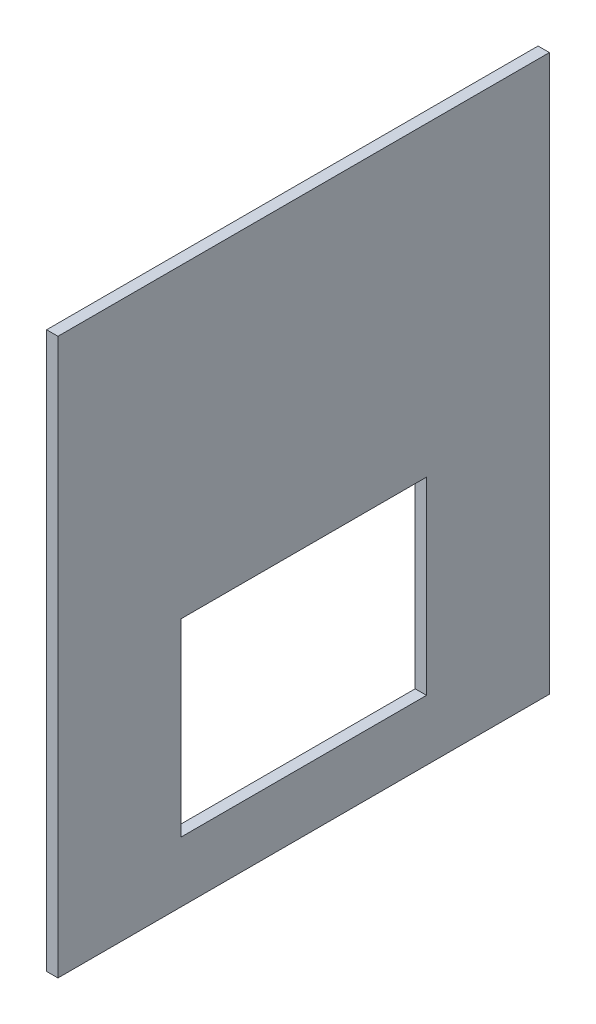
ISO-10303-21;
HEADER;
FILE_DESCRIPTION(('STEP AP214'),'2;1');
FILE_NAME('part.step','',(''),(''),'','','');
FILE_SCHEMA(('AUTOMOTIVE_DESIGN { 1 0 10303 214 1 1 1 1 }'));
ENDSEC;
DATA;
#1=APPLICATION_CONTEXT('core data for automotive mechanical design processes');
#2=APPLICATION_PROTOCOL_DEFINITION('international standard','automotive_design',2000,#1);
#3=PRODUCT_CONTEXT('',#1,'mechanical');
#4=PRODUCT('Part','Part','',(#3));
#5=PRODUCT_RELATED_PRODUCT_CATEGORY('part','',(#4));
#6=PRODUCT_DEFINITION_FORMATION('','',#4);
#7=PRODUCT_DEFINITION_CONTEXT('part definition',#1,'design');
#8=PRODUCT_DEFINITION('design','',#6,#7);
#9=PRODUCT_DEFINITION_SHAPE('','',#8);
#10=(LENGTH_UNIT() NAMED_UNIT(*) SI_UNIT(.MILLI.,.METRE.));
#11=(NAMED_UNIT(*) PLANE_ANGLE_UNIT() SI_UNIT($,.RADIAN.));
#12=(NAMED_UNIT(*) SI_UNIT($,.STERADIAN.) SOLID_ANGLE_UNIT());
#13=UNCERTAINTY_MEASURE_WITH_UNIT(LENGTH_MEASURE(1.E-05),#10,'distance_accuracy_value','');
#14=(GEOMETRIC_REPRESENTATION_CONTEXT(3) GLOBAL_UNCERTAINTY_ASSIGNED_CONTEXT((#13)) GLOBAL_UNIT_ASSIGNED_CONTEXT((#10,
#11,#12)) REPRESENTATION_CONTEXT('',''));
#15=CARTESIAN_POINT('',(0.,0.,0.));
#16=DIRECTION('',(0.,0.,1.));
#17=DIRECTION('',(1.,0.,0.));
#18=AXIS2_PLACEMENT_3D('',#15,#16,#17);
#19=CARTESIAN_POINT('',(3.,0.,0.));
#20=DIRECTION('',(-1.,0.,0.));
#21=DIRECTION('',(0.,0.,1.));
#22=AXIS2_PLACEMENT_3D('',#19,#20,#21);
#23=PLANE('',#22);
#24=DIRECTION('',(0.,-1.,0.));
#25=VECTOR('',#24,1.);
#26=CARTESIAN_POINT('',(3.,0.,0.));
#27=LINE('',#26,#25);
#28=CARTESIAN_POINT('',(3.,147.,0.));
#29=VERTEX_POINT('',#28);
#30=CARTESIAN_POINT('',(3.,0.,0.));
#31=VERTEX_POINT('',#30);
#32=EDGE_CURVE('E134',#29,#31,#27,.T.);
#33=ORIENTED_EDGE('',*,*,#32,.T.);
#34=DIRECTION('',(0.,0.,-1.));
#35=VECTOR('',#34,1.);
#36=CARTESIAN_POINT('',(3.,0.,0.));
#37=LINE('',#36,#35);
#38=CARTESIAN_POINT('',(3.,0.,-130.));
#39=VERTEX_POINT('',#38);
#40=EDGE_CURVE('E137',#31,#39,#37,.T.);
#41=ORIENTED_EDGE('',*,*,#40,.T.);
#42=DIRECTION('',(0.,1.,0.));
#43=VECTOR('',#42,1.);
#44=CARTESIAN_POINT('',(3.,0.,-130.));
#45=LINE('',#44,#43);
#46=CARTESIAN_POINT('',(3.,147.,-130.));
#47=VERTEX_POINT('',#46);
#48=EDGE_CURVE('E140',#39,#47,#45,.T.);
#49=ORIENTED_EDGE('',*,*,#48,.T.);
#50=DIRECTION('',(0.,0.,1.));
#51=VECTOR('',#50,1.);
#52=CARTESIAN_POINT('',(3.,147.,0.));
#53=LINE('',#52,#51);
#54=EDGE_CURVE('E142',#47,#29,#53,.T.);
#55=ORIENTED_EDGE('',*,*,#54,.T.);
#56=EDGE_LOOP('',(#33,#41,#49,#55));
#57=FACE_BOUND('',#56,.T.);
#58=DIRECTION('',(0.,-1.,0.));
#59=VECTOR('',#58,1.);
#60=CARTESIAN_POINT('',(3.,66.,-32.5));
#61=LINE('',#60,#59);
#62=CARTESIAN_POINT('',(3.,66.,-32.5));
#63=VERTEX_POINT('',#62);
#64=CARTESIAN_POINT('',(3.,16.,-32.5));
#65=VERTEX_POINT('',#64);
#66=EDGE_CURVE('E98',#63,#65,#61,.T.);
#67=ORIENTED_EDGE('',*,*,#66,.F.);
#68=DIRECTION('',(0.,0.,1.));
#69=VECTOR('',#68,1.);
#70=CARTESIAN_POINT('',(3.,66.,-32.5));
#71=LINE('',#70,#69);
#72=CARTESIAN_POINT('',(3.,66.,-97.5));
#73=VERTEX_POINT('',#72);
#74=EDGE_CURVE('E120',#73,#63,#71,.T.);
#75=ORIENTED_EDGE('',*,*,#74,.F.);
#76=DIRECTION('',(0.,1.,0.));
#77=VECTOR('',#76,1.);
#78=CARTESIAN_POINT('',(3.,66.,-97.5));
#79=LINE('',#78,#77);
#80=CARTESIAN_POINT('',(3.,16.,-97.5));
#81=VERTEX_POINT('',#80);
#82=EDGE_CURVE('E118',#81,#73,#79,.T.);
#83=ORIENTED_EDGE('',*,*,#82,.F.);
#84=DIRECTION('',(0.,0.,-1.));
#85=VECTOR('',#84,1.);
#86=CARTESIAN_POINT('',(3.,16.,-32.5));
#87=LINE('',#86,#85);
#88=EDGE_CURVE('E106',#65,#81,#87,.T.);
#89=ORIENTED_EDGE('',*,*,#88,.F.);
#90=EDGE_LOOP('',(#67,#75,#83,#89));
#91=FACE_BOUND('',#90,.T.);
#92=ADVANCED_FACE('F33',(#57,#91),#23,.F.);
#93=CARTESIAN_POINT('',(0.,0.,0.));
#94=DIRECTION('',(-1.,0.,0.));
#95=DIRECTION('',(0.,0.,1.));
#96=AXIS2_PLACEMENT_3D('',#93,#94,#95);
#97=PLANE('',#96);
#98=DIRECTION('',(0.,-1.,0.));
#99=VECTOR('',#98,1.);
#100=CARTESIAN_POINT('',(0.,0.,0.));
#101=LINE('',#100,#99);
#102=CARTESIAN_POINT('',(0.,147.,0.));
#103=VERTEX_POINT('',#102);
#104=CARTESIAN_POINT('',(0.,0.,0.));
#105=VERTEX_POINT('',#104);
#106=EDGE_CURVE('E114',#103,#105,#101,.T.);
#107=ORIENTED_EDGE('',*,*,#106,.F.);
#108=DIRECTION('',(0.,0.,1.));
#109=VECTOR('',#108,1.);
#110=CARTESIAN_POINT('',(0.,147.,0.));
#111=LINE('',#110,#109);
#112=CARTESIAN_POINT('',(0.,147.,-130.));
#113=VERTEX_POINT('',#112);
#114=EDGE_CURVE('E138',#113,#103,#111,.T.);
#115=ORIENTED_EDGE('',*,*,#114,.F.);
#116=DIRECTION('',(0.,1.,0.));
#117=VECTOR('',#116,1.);
#118=CARTESIAN_POINT('',(0.,0.,-130.));
#119=LINE('',#118,#117);
#120=CARTESIAN_POINT('',(0.,0.,-130.));
#121=VERTEX_POINT('',#120);
#122=EDGE_CURVE('E149',#121,#113,#119,.T.);
#123=ORIENTED_EDGE('',*,*,#122,.F.);
#124=DIRECTION('',(0.,0.,-1.));
#125=VECTOR('',#124,1.);
#126=CARTESIAN_POINT('',(0.,0.,0.));
#127=LINE('',#126,#125);
#128=EDGE_CURVE('E147',#105,#121,#127,.T.);
#129=ORIENTED_EDGE('',*,*,#128,.F.);
#130=EDGE_LOOP('',(#107,#115,#123,#129));
#131=FACE_BOUND('',#130,.T.);
#132=DIRECTION('',(0.,0.,1.));
#133=VECTOR('',#132,1.);
#134=CARTESIAN_POINT('',(0.,66.,-32.5));
#135=LINE('',#134,#133);
#136=CARTESIAN_POINT('',(0.,66.,-97.5));
#137=VERTEX_POINT('',#136);
#138=CARTESIAN_POINT('',(0.,66.,-32.5));
#139=VERTEX_POINT('',#138);
#140=EDGE_CURVE('E107',#137,#139,#135,.T.);
#141=ORIENTED_EDGE('',*,*,#140,.T.);
#142=DIRECTION('',(0.,-1.,0.));
#143=VECTOR('',#142,1.);
#144=CARTESIAN_POINT('',(0.,66.,-32.5));
#145=LINE('',#144,#143);
#146=CARTESIAN_POINT('',(0.,16.,-32.5));
#147=VERTEX_POINT('',#146);
#148=EDGE_CURVE('E56',#139,#147,#145,.T.);
#149=ORIENTED_EDGE('',*,*,#148,.T.);
#150=DIRECTION('',(0.,0.,-1.));
#151=VECTOR('',#150,1.);
#152=CARTESIAN_POINT('',(0.,16.,-32.5));
#153=LINE('',#152,#151);
#154=CARTESIAN_POINT('',(0.,16.,-97.5));
#155=VERTEX_POINT('',#154);
#156=EDGE_CURVE('E113',#147,#155,#153,.T.);
#157=ORIENTED_EDGE('',*,*,#156,.T.);
#158=DIRECTION('',(0.,1.,0.));
#159=VECTOR('',#158,1.);
#160=CARTESIAN_POINT('',(0.,66.,-97.5));
#161=LINE('',#160,#159);
#162=EDGE_CURVE('E126',#155,#137,#161,.T.);
#163=ORIENTED_EDGE('',*,*,#162,.T.);
#164=EDGE_LOOP('',(#141,#149,#157,#163));
#165=FACE_BOUND('',#164,.T.);
#166=ADVANCED_FACE('F167',(#131,#165),#97,.T.);
#167=CARTESIAN_POINT('',(3.,0.,0.));
#168=DIRECTION('',(0.,0.,-1.));
#169=DIRECTION('',(-1.,0.,0.));
#170=AXIS2_PLACEMENT_3D('',#167,#168,#169);
#171=PLANE('',#170);
#172=ORIENTED_EDGE('',*,*,#106,.T.);
#173=DIRECTION('',(-1.,0.,0.));
#174=VECTOR('',#173,1.);
#175=CARTESIAN_POINT('',(3.,0.,0.));
#176=LINE('',#175,#174);
#177=EDGE_CURVE('E11',#31,#105,#176,.T.);
#178=ORIENTED_EDGE('',*,*,#177,.F.);
#179=ORIENTED_EDGE('',*,*,#32,.F.);
#180=DIRECTION('',(-1.,0.,0.));
#181=VECTOR('',#180,1.);
#182=CARTESIAN_POINT('',(3.,147.,0.));
#183=LINE('',#182,#181);
#184=EDGE_CURVE('E144',#29,#103,#183,.T.);
#185=ORIENTED_EDGE('',*,*,#184,.T.);
#186=EDGE_LOOP('',(#172,#178,#179,#185));
#187=FACE_BOUND('',#186,.T.);
#188=ADVANCED_FACE('F35',(#187),#171,.F.);
#189=CARTESIAN_POINT('',(3.,0.,0.));
#190=DIRECTION('',(0.,1.,0.));
#191=DIRECTION('',(0.,0.,1.));
#192=AXIS2_PLACEMENT_3D('',#189,#190,#191);
#193=PLANE('',#192);
#194=ORIENTED_EDGE('',*,*,#128,.T.);
#195=DIRECTION('',(-1.,0.,0.));
#196=VECTOR('',#195,1.);
#197=CARTESIAN_POINT('',(3.,0.,-130.));
#198=LINE('',#197,#196);
#199=EDGE_CURVE('E41',#39,#121,#198,.T.);
#200=ORIENTED_EDGE('',*,*,#199,.F.);
#201=ORIENTED_EDGE('',*,*,#40,.F.);
#202=ORIENTED_EDGE('',*,*,#177,.T.);
#203=EDGE_LOOP('',(#194,#200,#201,#202));
#204=FACE_BOUND('',#203,.T.);
#205=ADVANCED_FACE('F177',(#204),#193,.F.);
#206=CARTESIAN_POINT('',(3.,0.,-130.));
#207=DIRECTION('',(0.,0.,1.));
#208=DIRECTION('',(1.,0.,0.));
#209=AXIS2_PLACEMENT_3D('',#206,#207,#208);
#210=PLANE('',#209);
#211=ORIENTED_EDGE('',*,*,#122,.T.);
#212=DIRECTION('',(-1.,0.,0.));
#213=VECTOR('',#212,1.);
#214=CARTESIAN_POINT('',(3.,147.,-130.));
#215=LINE('',#214,#213);
#216=EDGE_CURVE('E154',#47,#113,#215,.T.);
#217=ORIENTED_EDGE('',*,*,#216,.F.);
#218=ORIENTED_EDGE('',*,*,#48,.F.);
#219=ORIENTED_EDGE('',*,*,#199,.T.);
#220=EDGE_LOOP('',(#211,#217,#218,#219));
#221=FACE_BOUND('',#220,.T.);
#222=ADVANCED_FACE('F161',(#221),#210,.F.);
#223=CARTESIAN_POINT('',(3.,147.,0.));
#224=DIRECTION('',(0.,-1.,0.));
#225=DIRECTION('',(0.,0.,-1.));
#226=AXIS2_PLACEMENT_3D('',#223,#224,#225);
#227=PLANE('',#226);
#228=ORIENTED_EDGE('',*,*,#114,.T.);
#229=ORIENTED_EDGE('',*,*,#184,.F.);
#230=ORIENTED_EDGE('',*,*,#54,.F.);
#231=ORIENTED_EDGE('',*,*,#216,.T.);
#232=EDGE_LOOP('',(#228,#229,#230,#231));
#233=FACE_BOUND('',#232,.T.);
#234=ADVANCED_FACE('F171',(#233),#227,.F.);
#235=CARTESIAN_POINT('',(3.,66.,-32.5));
#236=DIRECTION('',(0.,0.,-1.));
#237=DIRECTION('',(0.,1.,0.));
#238=AXIS2_PLACEMENT_3D('',#235,#236,#237);
#239=PLANE('',#238);
#240=ORIENTED_EDGE('',*,*,#148,.F.);
#241=DIRECTION('',(-1.,0.,0.));
#242=VECTOR('',#241,1.);
#243=CARTESIAN_POINT('',(3.,66.,-32.5));
#244=LINE('',#243,#242);
#245=EDGE_CURVE('E102',#63,#139,#244,.T.);
#246=ORIENTED_EDGE('',*,*,#245,.F.);
#247=ORIENTED_EDGE('',*,*,#66,.T.);
#248=DIRECTION('',(-1.,0.,0.));
#249=VECTOR('',#248,1.);
#250=CARTESIAN_POINT('',(3.,16.,-32.5));
#251=LINE('',#250,#249);
#252=EDGE_CURVE('E101',#65,#147,#251,.T.);
#253=ORIENTED_EDGE('',*,*,#252,.T.);
#254=EDGE_LOOP('',(#240,#246,#247,#253));
#255=FACE_BOUND('',#254,.T.);
#256=ADVANCED_FACE('F100',(#255),#239,.T.);
#257=CARTESIAN_POINT('',(3.,16.,-32.5));
#258=DIRECTION('',(0.,1.,0.));
#259=DIRECTION('',(0.,0.,1.));
#260=AXIS2_PLACEMENT_3D('',#257,#258,#259);
#261=PLANE('',#260);
#262=ORIENTED_EDGE('',*,*,#156,.F.);
#263=ORIENTED_EDGE('',*,*,#252,.F.);
#264=ORIENTED_EDGE('',*,*,#88,.T.);
#265=DIRECTION('',(-1.,0.,0.));
#266=VECTOR('',#265,1.);
#267=CARTESIAN_POINT('',(3.,16.,-97.5));
#268=LINE('',#267,#266);
#269=EDGE_CURVE('E115',#81,#155,#268,.T.);
#270=ORIENTED_EDGE('',*,*,#269,.T.);
#271=EDGE_LOOP('',(#262,#263,#264,#270));
#272=FACE_BOUND('',#271,.T.);
#273=ADVANCED_FACE('F110',(#272),#261,.T.);
#274=CARTESIAN_POINT('',(3.,66.,-97.5));
#275=DIRECTION('',(0.,0.,1.));
#276=DIRECTION('',(1.,0.,0.));
#277=AXIS2_PLACEMENT_3D('',#274,#275,#276);
#278=PLANE('',#277);
#279=ORIENTED_EDGE('',*,*,#162,.F.);
#280=ORIENTED_EDGE('',*,*,#269,.F.);
#281=ORIENTED_EDGE('',*,*,#82,.T.);
#282=DIRECTION('',(-1.,0.,0.));
#283=VECTOR('',#282,1.);
#284=CARTESIAN_POINT('',(3.,66.,-97.5));
#285=LINE('',#284,#283);
#286=EDGE_CURVE('E48',#73,#137,#285,.T.);
#287=ORIENTED_EDGE('',*,*,#286,.T.);
#288=EDGE_LOOP('',(#279,#280,#281,#287));
#289=FACE_BOUND('',#288,.T.);
#290=ADVANCED_FACE('F200',(#289),#278,.T.);
#291=CARTESIAN_POINT('',(3.,66.,-32.5));
#292=DIRECTION('',(0.,-1.,0.));
#293=DIRECTION('',(0.,0.,-1.));
#294=AXIS2_PLACEMENT_3D('',#291,#292,#293);
#295=PLANE('',#294);
#296=ORIENTED_EDGE('',*,*,#140,.F.);
#297=ORIENTED_EDGE('',*,*,#286,.F.);
#298=ORIENTED_EDGE('',*,*,#74,.T.);
#299=ORIENTED_EDGE('',*,*,#245,.T.);
#300=EDGE_LOOP('',(#296,#297,#298,#299));
#301=FACE_BOUND('',#300,.T.);
#302=ADVANCED_FACE('F204',(#301),#295,.T.);
#303=CLOSED_SHELL('',(#92,#166,#188,#205,#222,#234,#256,#273,#290,#302));
#304=MANIFOLD_SOLID_BREP('B2',#303);
#305=ADVANCED_BREP_SHAPE_REPRESENTATION('',(#18,#304),#14);
#306=SHAPE_DEFINITION_REPRESENTATION(#9,#305);
ENDSEC;
END-ISO-10303-21;
